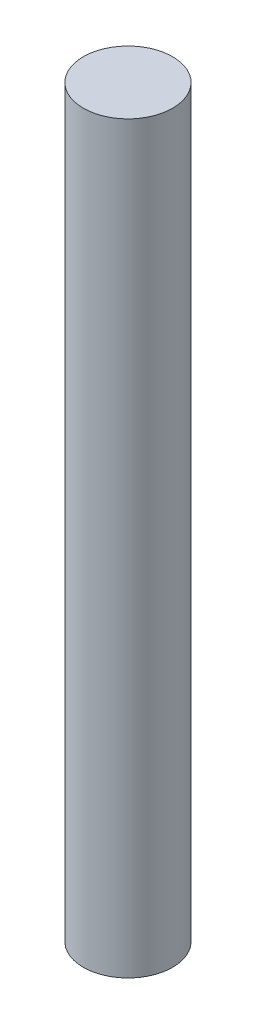
ISO-10303-21;
HEADER;
FILE_DESCRIPTION(('STEP AP214'),'2;1');
FILE_NAME('part.step','',(''),(''),'','','');
FILE_SCHEMA(('AUTOMOTIVE_DESIGN { 1 0 10303 214 1 1 1 1 }'));
ENDSEC;
DATA;
#1=APPLICATION_CONTEXT('core data for automotive mechanical design processes');
#2=APPLICATION_PROTOCOL_DEFINITION('international standard','automotive_design',2000,#1);
#3=PRODUCT_CONTEXT('',#1,'mechanical');
#4=PRODUCT('Part','Part','',(#3));
#5=PRODUCT_RELATED_PRODUCT_CATEGORY('part','',(#4));
#6=PRODUCT_DEFINITION_FORMATION('','',#4);
#7=PRODUCT_DEFINITION_CONTEXT('part definition',#1,'design');
#8=PRODUCT_DEFINITION('design','',#6,#7);
#9=PRODUCT_DEFINITION_SHAPE('','',#8);
#10=(LENGTH_UNIT() NAMED_UNIT(*) SI_UNIT(.MILLI.,.METRE.));
#11=(NAMED_UNIT(*) PLANE_ANGLE_UNIT() SI_UNIT($,.RADIAN.));
#12=(NAMED_UNIT(*) SI_UNIT($,.STERADIAN.) SOLID_ANGLE_UNIT());
#13=UNCERTAINTY_MEASURE_WITH_UNIT(LENGTH_MEASURE(1.E-05),#10,'distance_accuracy_value','');
#14=(GEOMETRIC_REPRESENTATION_CONTEXT(3) GLOBAL_UNCERTAINTY_ASSIGNED_CONTEXT((#13)) GLOBAL_UNIT_ASSIGNED_CONTEXT((#10,
#11,#12)) REPRESENTATION_CONTEXT('',''));
#15=CARTESIAN_POINT('',(0.,0.,0.));
#16=DIRECTION('',(0.,0.,1.));
#17=DIRECTION('',(1.,0.,0.));
#18=AXIS2_PLACEMENT_3D('',#15,#16,#17);
#19=CARTESIAN_POINT('',(0.,50.,0.));
#20=DIRECTION('',(0.,-1.,0.));
#21=DIRECTION('',(0.,0.,-1.));
#22=AXIS2_PLACEMENT_3D('',#19,#20,#21);
#23=CYLINDRICAL_SURFACE('',#22,3.);
#24=CARTESIAN_POINT('',(0.,50.,0.));
#25=DIRECTION('',(0.,1.,0.));
#26=DIRECTION('',(0.,0.,1.));
#27=AXIS2_PLACEMENT_3D('',#24,#25,#26);
#28=CIRCLE('',#27,3.);
#29=CARTESIAN_POINT('',(0.,50.,3.));
#30=VERTEX_POINT('',#29);
#31=EDGE_CURVE('E10',#30,#30,#28,.T.);
#32=ORIENTED_EDGE('',*,*,#31,.F.);
#33=EDGE_LOOP('',(#32));
#34=FACE_BOUND('',#33,.T.);
#35=CARTESIAN_POINT('',(0.,0.,0.));
#36=DIRECTION('',(0.,1.,0.));
#37=DIRECTION('',(0.,0.,1.));
#38=AXIS2_PLACEMENT_3D('',#35,#36,#37);
#39=CIRCLE('',#38,3.);
#40=CARTESIAN_POINT('',(0.,0.,3.));
#41=VERTEX_POINT('',#40);
#42=EDGE_CURVE('E39',#41,#41,#39,.T.);
#43=ORIENTED_EDGE('',*,*,#42,.T.);
#44=EDGE_LOOP('',(#43));
#45=FACE_BOUND('',#44,.T.);
#46=ADVANCED_FACE('F36',(#34,#45),#23,.T.);
#47=CARTESIAN_POINT('',(0.,50.,0.));
#48=DIRECTION('',(0.,1.,0.));
#49=DIRECTION('',(0.,0.,1.));
#50=AXIS2_PLACEMENT_3D('',#47,#48,#49);
#51=PLANE('',#50);
#52=ORIENTED_EDGE('',*,*,#31,.T.);
#53=EDGE_LOOP('',(#52));
#54=FACE_BOUND('',#53,.T.);
#55=ADVANCED_FACE('F51',(#54),#51,.T.);
#56=CARTESIAN_POINT('',(0.,0.,0.));
#57=DIRECTION('',(0.,1.,0.));
#58=DIRECTION('',(0.,0.,1.));
#59=AXIS2_PLACEMENT_3D('',#56,#57,#58);
#60=PLANE('',#59);
#61=ORIENTED_EDGE('',*,*,#42,.F.);
#62=EDGE_LOOP('',(#61));
#63=FACE_BOUND('',#62,.T.);
#64=ADVANCED_FACE('F49',(#63),#60,.F.);
#65=CLOSED_SHELL('',(#46,#55,#64));
#66=MANIFOLD_SOLID_BREP('B2',#65);
#67=ADVANCED_BREP_SHAPE_REPRESENTATION('',(#18,#66),#14);
#68=SHAPE_DEFINITION_REPRESENTATION(#9,#67);
ENDSEC;
END-ISO-10303-21;
